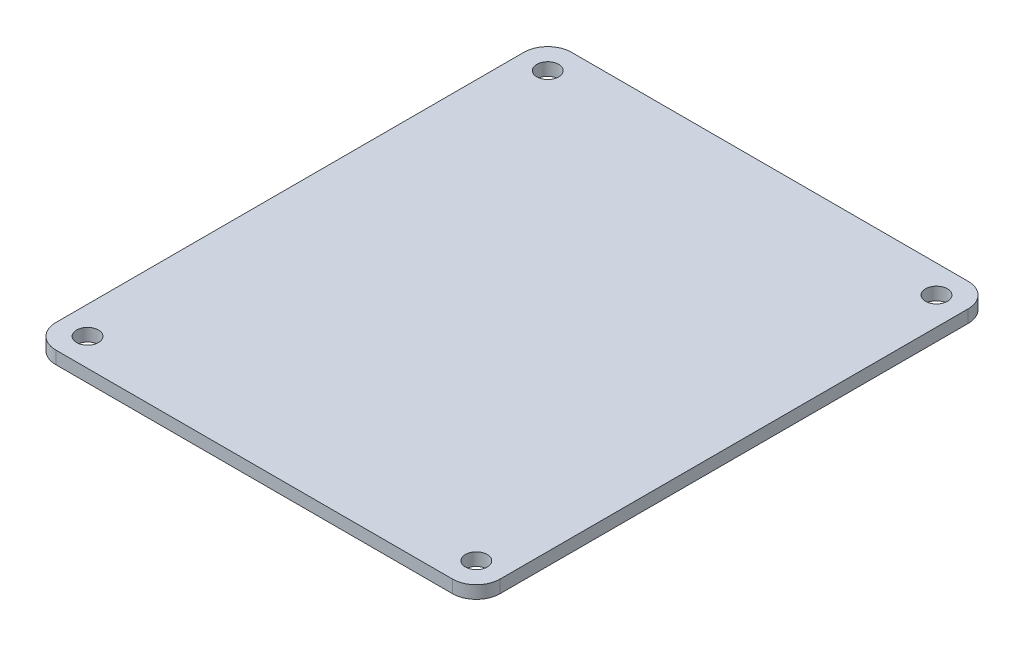
ISO-10303-21;
HEADER;
FILE_DESCRIPTION(('STEP AP214'),'2;1');
FILE_NAME('part.step','',(''),(''),'','','');
FILE_SCHEMA(('AUTOMOTIVE_DESIGN { 1 0 10303 214 1 1 1 1 }'));
ENDSEC;
DATA;
#1=APPLICATION_CONTEXT('core data for automotive mechanical design processes');
#2=APPLICATION_PROTOCOL_DEFINITION('international standard','automotive_design',2000,#1);
#3=PRODUCT_CONTEXT('',#1,'mechanical');
#4=PRODUCT('Part','Part','',(#3));
#5=PRODUCT_RELATED_PRODUCT_CATEGORY('part','',(#4));
#6=PRODUCT_DEFINITION_FORMATION('','',#4);
#7=PRODUCT_DEFINITION_CONTEXT('part definition',#1,'design');
#8=PRODUCT_DEFINITION('design','',#6,#7);
#9=PRODUCT_DEFINITION_SHAPE('','',#8);
#10=(LENGTH_UNIT() NAMED_UNIT(*) SI_UNIT(.MILLI.,.METRE.));
#11=(NAMED_UNIT(*) PLANE_ANGLE_UNIT() SI_UNIT($,.RADIAN.));
#12=(NAMED_UNIT(*) SI_UNIT($,.STERADIAN.) SOLID_ANGLE_UNIT());
#13=UNCERTAINTY_MEASURE_WITH_UNIT(LENGTH_MEASURE(1.E-05),#10,'distance_accuracy_value','');
#14=(GEOMETRIC_REPRESENTATION_CONTEXT(3) GLOBAL_UNCERTAINTY_ASSIGNED_CONTEXT((#13)) GLOBAL_UNIT_ASSIGNED_CONTEXT((#10,
#11,#12)) REPRESENTATION_CONTEXT('',''));
#15=CARTESIAN_POINT('',(0.,0.,0.));
#16=DIRECTION('',(0.,0.,1.));
#17=DIRECTION('',(1.,0.,0.));
#18=AXIS2_PLACEMENT_3D('',#15,#16,#17);
#19=CARTESIAN_POINT('',(3.00000000000001,1.6002,-61.9999999999998));
#20=DIRECTION('',(0.,-1.,0.));
#21=DIRECTION('',(0.,0.,-1.));
#22=AXIS2_PLACEMENT_3D('',#19,#20,#21);
#23=CYLINDRICAL_SURFACE('',#22,3.00000000000006);
#24=CARTESIAN_POINT('',(3.00000000000001,0.,-61.9999999999998));
#25=DIRECTION('',(0.,1.,0.));
#26=DIRECTION('',(0.,0.,-1.));
#27=AXIS2_PLACEMENT_3D('',#24,#25,#26);
#28=CIRCLE('',#27,3.00000000000006);
#29=CARTESIAN_POINT('',(3.,0.,-64.9999999999999));
#30=VERTEX_POINT('',#29);
#31=CARTESIAN_POINT('',(0.,0.,-61.9999999999998));
#32=VERTEX_POINT('',#31);
#33=EDGE_CURVE('E130',#30,#32,#28,.T.);
#34=ORIENTED_EDGE('',*,*,#33,.T.);
#35=DIRECTION('',(0.,-1.,0.));
#36=VECTOR('',#35,1.);
#37=CARTESIAN_POINT('',(0.,1.6002,-61.9999999999998));
#38=LINE('',#37,#36);
#39=CARTESIAN_POINT('',(0.,1.6002,-61.9999999999998));
#40=VERTEX_POINT('',#39);
#41=EDGE_CURVE('E11',#40,#32,#38,.T.);
#42=ORIENTED_EDGE('',*,*,#41,.F.);
#43=CARTESIAN_POINT('',(3.00000000000001,1.6002,-61.9999999999998));
#44=DIRECTION('',(0.,1.,0.));
#45=DIRECTION('',(0.,0.,-1.));
#46=AXIS2_PLACEMENT_3D('',#43,#44,#45);
#47=CIRCLE('',#46,3.00000000000006);
#48=CARTESIAN_POINT('',(3.,1.6002,-64.9999999999999));
#49=VERTEX_POINT('',#48);
#50=EDGE_CURVE('E145',#49,#40,#47,.T.);
#51=ORIENTED_EDGE('',*,*,#50,.F.);
#52=DIRECTION('',(0.,-1.,0.));
#53=VECTOR('',#52,1.);
#54=CARTESIAN_POINT('',(3.,1.6002,-64.9999999999999));
#55=LINE('',#54,#53);
#56=EDGE_CURVE('E126',#49,#30,#55,.T.);
#57=ORIENTED_EDGE('',*,*,#56,.T.);
#58=EDGE_LOOP('',(#34,#42,#51,#57));
#59=FACE_BOUND('',#58,.T.);
#60=ADVANCED_FACE('F34',(#59),#23,.T.);
#61=CARTESIAN_POINT('',(0.,1.6002,-3.00000000000002));
#62=DIRECTION('',(1.,0.,0.));
#63=DIRECTION('',(0.,0.,-1.));
#64=AXIS2_PLACEMENT_3D('',#61,#62,#63);
#65=PLANE('',#64);
#66=DIRECTION('',(0.,0.,1.));
#67=VECTOR('',#66,1.);
#68=CARTESIAN_POINT('',(0.,0.,-3.00000000000002));
#69=LINE('',#68,#67);
#70=CARTESIAN_POINT('',(0.,0.,-3.00000000000002));
#71=VERTEX_POINT('',#70);
#72=EDGE_CURVE('E133',#32,#71,#69,.T.);
#73=ORIENTED_EDGE('',*,*,#72,.T.);
#74=DIRECTION('',(0.,-1.,0.));
#75=VECTOR('',#74,1.);
#76=CARTESIAN_POINT('',(0.,1.6002,-3.00000000000002));
#77=LINE('',#76,#75);
#78=CARTESIAN_POINT('',(0.,1.6002,-3.00000000000002));
#79=VERTEX_POINT('',#78);
#80=EDGE_CURVE('E42',#79,#71,#77,.T.);
#81=ORIENTED_EDGE('',*,*,#80,.F.);
#82=DIRECTION('',(0.,0.,1.));
#83=VECTOR('',#82,1.);
#84=CARTESIAN_POINT('',(0.,1.6002,-3.00000000000002));
#85=LINE('',#84,#83);
#86=EDGE_CURVE('E93',#40,#79,#85,.T.);
#87=ORIENTED_EDGE('',*,*,#86,.F.);
#88=ORIENTED_EDGE('',*,*,#41,.T.);
#89=EDGE_LOOP('',(#73,#81,#87,#88));
#90=FACE_BOUND('',#89,.T.);
#91=ADVANCED_FACE('F230',(#90),#65,.F.);
#92=CARTESIAN_POINT('',(3.,1.6002,-3.));
#93=DIRECTION('',(0.,-1.,0.));
#94=DIRECTION('',(0.,0.,-1.));
#95=AXIS2_PLACEMENT_3D('',#92,#93,#94);
#96=CYLINDRICAL_SURFACE('',#95,3.);
#97=CARTESIAN_POINT('',(3.,0.,-3.));
#98=DIRECTION('',(0.,1.,0.));
#99=DIRECTION('',(0.,0.,-1.));
#100=AXIS2_PLACEMENT_3D('',#97,#98,#99);
#101=CIRCLE('',#100,3.);
#102=CARTESIAN_POINT('',(3.00000000000002,0.,0.));
#103=VERTEX_POINT('',#102);
#104=EDGE_CURVE('E136',#71,#103,#101,.T.);
#105=ORIENTED_EDGE('',*,*,#104,.T.);
#106=DIRECTION('',(0.,-1.,0.));
#107=VECTOR('',#106,1.);
#108=CARTESIAN_POINT('',(3.00000000000002,1.6002,0.));
#109=LINE('',#108,#107);
#110=CARTESIAN_POINT('',(3.00000000000002,1.6002,0.));
#111=VERTEX_POINT('',#110);
#112=EDGE_CURVE('E152',#111,#103,#109,.T.);
#113=ORIENTED_EDGE('',*,*,#112,.F.);
#114=CARTESIAN_POINT('',(3.,1.6002,-3.));
#115=DIRECTION('',(0.,1.,0.));
#116=DIRECTION('',(0.,0.,-1.));
#117=AXIS2_PLACEMENT_3D('',#114,#115,#116);
#118=CIRCLE('',#117,3.);
#119=EDGE_CURVE('E160',#79,#111,#118,.T.);
#120=ORIENTED_EDGE('',*,*,#119,.F.);
#121=ORIENTED_EDGE('',*,*,#80,.T.);
#122=EDGE_LOOP('',(#105,#113,#120,#121));
#123=FACE_BOUND('',#122,.T.);
#124=ADVANCED_FACE('F158',(#123),#96,.T.);
#125=CARTESIAN_POINT('',(3.00000000000002,1.6002,0.));
#126=DIRECTION('',(0.,0.,-1.));
#127=DIRECTION('',(-1.,0.,0.));
#128=AXIS2_PLACEMENT_3D('',#125,#126,#127);
#129=PLANE('',#128);
#130=DIRECTION('',(1.,0.,0.));
#131=VECTOR('',#130,1.);
#132=CARTESIAN_POINT('',(3.00000000000002,0.,0.));
#133=LINE('',#132,#131);
#134=CARTESIAN_POINT('',(53.,0.,0.));
#135=VERTEX_POINT('',#134);
#136=EDGE_CURVE('E138',#103,#135,#133,.T.);
#137=ORIENTED_EDGE('',*,*,#136,.T.);
#138=DIRECTION('',(0.,-1.,0.));
#139=VECTOR('',#138,1.);
#140=CARTESIAN_POINT('',(53.,1.6002,0.));
#141=LINE('',#140,#139);
#142=CARTESIAN_POINT('',(53.,1.6002,0.));
#143=VERTEX_POINT('',#142);
#144=EDGE_CURVE('E149',#143,#135,#141,.T.);
#145=ORIENTED_EDGE('',*,*,#144,.F.);
#146=DIRECTION('',(1.,0.,0.));
#147=VECTOR('',#146,1.);
#148=CARTESIAN_POINT('',(3.00000000000002,1.6002,0.));
#149=LINE('',#148,#147);
#150=EDGE_CURVE('E172',#111,#143,#149,.T.);
#151=ORIENTED_EDGE('',*,*,#150,.F.);
#152=ORIENTED_EDGE('',*,*,#112,.T.);
#153=EDGE_LOOP('',(#137,#145,#151,#152));
#154=FACE_BOUND('',#153,.T.);
#155=ADVANCED_FACE('F168',(#154),#129,.F.);
#156=CARTESIAN_POINT('',(53.,1.6002,-3.));
#157=DIRECTION('',(0.,-1.,0.));
#158=DIRECTION('',(0.,0.,-1.));
#159=AXIS2_PLACEMENT_3D('',#156,#157,#158);
#160=CYLINDRICAL_SURFACE('',#159,3.);
#161=CARTESIAN_POINT('',(53.,0.,-3.));
#162=DIRECTION('',(0.,1.,0.));
#163=DIRECTION('',(0.,0.,1.));
#164=AXIS2_PLACEMENT_3D('',#161,#162,#163);
#165=CIRCLE('',#164,3.);
#166=CARTESIAN_POINT('',(56.,0.,-2.99999999999999));
#167=VERTEX_POINT('',#166);
#168=EDGE_CURVE('E140',#135,#167,#165,.T.);
#169=ORIENTED_EDGE('',*,*,#168,.T.);
#170=DIRECTION('',(0.,-1.,0.));
#171=VECTOR('',#170,1.);
#172=CARTESIAN_POINT('',(56.,1.6002,-2.99999999999999));
#173=LINE('',#172,#171);
#174=CARTESIAN_POINT('',(56.,1.6002,-2.99999999999999));
#175=VERTEX_POINT('',#174);
#176=EDGE_CURVE('E121',#175,#167,#173,.T.);
#177=ORIENTED_EDGE('',*,*,#176,.F.);
#178=CARTESIAN_POINT('',(53.,1.6002,-3.));
#179=DIRECTION('',(0.,1.,0.));
#180=DIRECTION('',(0.,0.,1.));
#181=AXIS2_PLACEMENT_3D('',#178,#179,#180);
#182=CIRCLE('',#181,3.);
#183=EDGE_CURVE('E112',#143,#175,#182,.T.);
#184=ORIENTED_EDGE('',*,*,#183,.F.);
#185=ORIENTED_EDGE('',*,*,#144,.T.);
#186=EDGE_LOOP('',(#169,#177,#184,#185));
#187=FACE_BOUND('',#186,.T.);
#188=ADVANCED_FACE('F171',(#187),#160,.T.);
#189=CARTESIAN_POINT('',(56.,1.6002,-2.99999999999999));
#190=DIRECTION('',(-1.,0.,0.));
#191=DIRECTION('',(0.,0.,1.));
#192=AXIS2_PLACEMENT_3D('',#189,#190,#191);
#193=PLANE('',#192);
#194=DIRECTION('',(0.,0.,-1.));
#195=VECTOR('',#194,1.);
#196=CARTESIAN_POINT('',(56.,0.,-2.99999999999999));
#197=LINE('',#196,#195);
#198=CARTESIAN_POINT('',(56.,0.,-61.9999999999998));
#199=VERTEX_POINT('',#198);
#200=EDGE_CURVE('E120',#167,#199,#197,.T.);
#201=ORIENTED_EDGE('',*,*,#200,.T.);
#202=DIRECTION('',(0.,-1.,0.));
#203=VECTOR('',#202,1.);
#204=CARTESIAN_POINT('',(56.,1.6002,-61.9999999999998));
#205=LINE('',#204,#203);
#206=CARTESIAN_POINT('',(56.,1.6002,-61.9999999999998));
#207=VERTEX_POINT('',#206);
#208=EDGE_CURVE('E117',#207,#199,#205,.T.);
#209=ORIENTED_EDGE('',*,*,#208,.F.);
#210=DIRECTION('',(0.,0.,-1.));
#211=VECTOR('',#210,1.);
#212=CARTESIAN_POINT('',(56.,1.6002,-2.99999999999999));
#213=LINE('',#212,#211);
#214=EDGE_CURVE('E106',#175,#207,#213,.T.);
#215=ORIENTED_EDGE('',*,*,#214,.F.);
#216=ORIENTED_EDGE('',*,*,#176,.T.);
#217=EDGE_LOOP('',(#201,#209,#215,#216));
#218=FACE_BOUND('',#217,.T.);
#219=ADVANCED_FACE('F118',(#218),#193,.F.);
#220=CARTESIAN_POINT('',(53.,1.6002,-61.9999999999998));
#221=DIRECTION('',(0.,-1.,0.));
#222=DIRECTION('',(0.,0.,-1.));
#223=AXIS2_PLACEMENT_3D('',#220,#221,#222);
#224=CYLINDRICAL_SURFACE('',#223,3.00000000000006);
#225=CARTESIAN_POINT('',(53.,0.,-61.9999999999998));
#226=DIRECTION('',(0.,1.,0.));
#227=DIRECTION('',(0.,0.,-1.));
#228=AXIS2_PLACEMENT_3D('',#225,#226,#227);
#229=CIRCLE('',#228,3.00000000000006);
#230=CARTESIAN_POINT('',(53.,0.,-64.9999999999999));
#231=VERTEX_POINT('',#230);
#232=EDGE_CURVE('E79',#199,#231,#229,.T.);
#233=ORIENTED_EDGE('',*,*,#232,.T.);
#234=DIRECTION('',(0.,-1.,0.));
#235=VECTOR('',#234,1.);
#236=CARTESIAN_POINT('',(53.,1.6002,-64.9999999999999));
#237=LINE('',#236,#235);
#238=CARTESIAN_POINT('',(53.,1.6002,-64.9999999999999));
#239=VERTEX_POINT('',#238);
#240=EDGE_CURVE('E122',#239,#231,#237,.T.);
#241=ORIENTED_EDGE('',*,*,#240,.F.);
#242=CARTESIAN_POINT('',(53.,1.6002,-61.9999999999998));
#243=DIRECTION('',(0.,1.,0.));
#244=DIRECTION('',(0.,0.,-1.));
#245=AXIS2_PLACEMENT_3D('',#242,#243,#244);
#246=CIRCLE('',#245,3.00000000000006);
#247=EDGE_CURVE('E110',#207,#239,#246,.T.);
#248=ORIENTED_EDGE('',*,*,#247,.F.);
#249=ORIENTED_EDGE('',*,*,#208,.T.);
#250=EDGE_LOOP('',(#233,#241,#248,#249));
#251=FACE_BOUND('',#250,.T.);
#252=ADVANCED_FACE('F124',(#251),#224,.T.);
#253=CARTESIAN_POINT('',(3.,1.6002,-64.9999999999999));
#254=DIRECTION('',(0.,0.,1.));
#255=DIRECTION('',(1.,0.,0.));
#256=AXIS2_PLACEMENT_3D('',#253,#254,#255);
#257=PLANE('',#256);
#258=DIRECTION('',(-1.,0.,0.));
#259=VECTOR('',#258,1.);
#260=CARTESIAN_POINT('',(3.,0.,-64.9999999999999));
#261=LINE('',#260,#259);
#262=EDGE_CURVE('E85',#231,#30,#261,.T.);
#263=ORIENTED_EDGE('',*,*,#262,.T.);
#264=ORIENTED_EDGE('',*,*,#56,.F.);
#265=DIRECTION('',(-1.,0.,0.));
#266=VECTOR('',#265,1.);
#267=CARTESIAN_POINT('',(3.,1.6002,-64.9999999999999));
#268=LINE('',#267,#266);
#269=EDGE_CURVE('E50',#239,#49,#268,.T.);
#270=ORIENTED_EDGE('',*,*,#269,.F.);
#271=ORIENTED_EDGE('',*,*,#240,.T.);
#272=EDGE_LOOP('',(#263,#264,#270,#271));
#273=FACE_BOUND('',#272,.T.);
#274=ADVANCED_FACE('F206',(#273),#257,.F.);
#275=CARTESIAN_POINT('',(3.00000000000001,1.6002,-61.9999999999998));
#276=DIRECTION('',(0.,-1.,0.));
#277=DIRECTION('',(0.,0.,-1.));
#278=AXIS2_PLACEMENT_3D('',#275,#276,#277);
#279=PLANE('',#278);
#280=CARTESIAN_POINT('',(3.50000000000001,1.6002,-61.4999999999999));
#281=DIRECTION('',(0.,1.,0.));
#282=DIRECTION('',(0.,0.,1.));
#283=AXIS2_PLACEMENT_3D('',#280,#281,#282);
#284=CIRCLE('',#283,1.375);
#285=CARTESIAN_POINT('',(3.50000000000001,1.6002,-60.1249999999999));
#286=VERTEX_POINT('',#285);
#287=EDGE_CURVE('E198',#286,#286,#284,.T.);
#288=ORIENTED_EDGE('',*,*,#287,.F.);
#289=EDGE_LOOP('',(#288));
#290=FACE_BOUND('',#289,.T.);
#291=CARTESIAN_POINT('',(3.50000000000001,1.6002,-3.49999999999988));
#292=DIRECTION('',(0.,1.,0.));
#293=DIRECTION('',(0.,0.,1.));
#294=AXIS2_PLACEMENT_3D('',#291,#292,#293);
#295=CIRCLE('',#294,1.375);
#296=CARTESIAN_POINT('',(3.50000000000001,1.6002,-2.12499999999989));
#297=VERTEX_POINT('',#296);
#298=EDGE_CURVE('E192',#297,#297,#295,.T.);
#299=ORIENTED_EDGE('',*,*,#298,.F.);
#300=EDGE_LOOP('',(#299));
#301=FACE_BOUND('',#300,.T.);
#302=CARTESIAN_POINT('',(52.5,1.6002,-61.4999999999999));
#303=DIRECTION('',(0.,1.,0.));
#304=DIRECTION('',(0.,0.,1.));
#305=AXIS2_PLACEMENT_3D('',#302,#303,#304);
#306=CIRCLE('',#305,1.375);
#307=CARTESIAN_POINT('',(52.5,1.6002,-60.1249999999999));
#308=VERTEX_POINT('',#307);
#309=EDGE_CURVE('E186',#308,#308,#306,.T.);
#310=ORIENTED_EDGE('',*,*,#309,.F.);
#311=EDGE_LOOP('',(#310));
#312=FACE_BOUND('',#311,.T.);
#313=CARTESIAN_POINT('',(52.5,1.6002,-3.49999999999988));
#314=DIRECTION('',(0.,1.,0.));
#315=DIRECTION('',(0.,0.,1.));
#316=AXIS2_PLACEMENT_3D('',#313,#314,#315);
#317=CIRCLE('',#316,1.375);
#318=CARTESIAN_POINT('',(52.5,1.6002,-2.12499999999988));
#319=VERTEX_POINT('',#318);
#320=EDGE_CURVE('E180',#319,#319,#317,.T.);
#321=ORIENTED_EDGE('',*,*,#320,.F.);
#322=EDGE_LOOP('',(#321));
#323=FACE_BOUND('',#322,.T.);
#324=ORIENTED_EDGE('',*,*,#50,.T.);
#325=ORIENTED_EDGE('',*,*,#86,.T.);
#326=ORIENTED_EDGE('',*,*,#119,.T.);
#327=ORIENTED_EDGE('',*,*,#150,.T.);
#328=ORIENTED_EDGE('',*,*,#183,.T.);
#329=ORIENTED_EDGE('',*,*,#214,.T.);
#330=ORIENTED_EDGE('',*,*,#247,.T.);
#331=ORIENTED_EDGE('',*,*,#269,.T.);
#332=EDGE_LOOP('',(#324,#325,#326,#327,#328,#329,#330,#331));
#333=FACE_BOUND('',#332,.T.);
#334=ADVANCED_FACE('F108',(#290,#301,#312,#323,#333),#279,.F.);
#335=CARTESIAN_POINT('',(3.00000000000001,0.,-61.9999999999998));
#336=DIRECTION('',(0.,-1.,0.));
#337=DIRECTION('',(0.,0.,-1.));
#338=AXIS2_PLACEMENT_3D('',#335,#336,#337);
#339=PLANE('',#338);
#340=CARTESIAN_POINT('',(3.50000000000001,0.,-61.4999999999999));
#341=DIRECTION('',(0.,1.,0.));
#342=DIRECTION('',(0.,0.,1.));
#343=AXIS2_PLACEMENT_3D('',#340,#341,#342);
#344=CIRCLE('',#343,1.375);
#345=CARTESIAN_POINT('',(3.50000000000001,0.,-60.1249999999999));
#346=VERTEX_POINT('',#345);
#347=EDGE_CURVE('E195',#346,#346,#344,.T.);
#348=ORIENTED_EDGE('',*,*,#347,.T.);
#349=EDGE_LOOP('',(#348));
#350=FACE_BOUND('',#349,.T.);
#351=CARTESIAN_POINT('',(3.50000000000001,0.,-3.49999999999988));
#352=DIRECTION('',(0.,1.,0.));
#353=DIRECTION('',(0.,0.,1.));
#354=AXIS2_PLACEMENT_3D('',#351,#352,#353);
#355=CIRCLE('',#354,1.375);
#356=CARTESIAN_POINT('',(3.50000000000001,0.,-2.12499999999989));
#357=VERTEX_POINT('',#356);
#358=EDGE_CURVE('E189',#357,#357,#355,.T.);
#359=ORIENTED_EDGE('',*,*,#358,.T.);
#360=EDGE_LOOP('',(#359));
#361=FACE_BOUND('',#360,.T.);
#362=CARTESIAN_POINT('',(52.5,0.,-61.4999999999999));
#363=DIRECTION('',(0.,1.,0.));
#364=DIRECTION('',(0.,0.,1.));
#365=AXIS2_PLACEMENT_3D('',#362,#363,#364);
#366=CIRCLE('',#365,1.375);
#367=CARTESIAN_POINT('',(52.5,0.,-60.1249999999999));
#368=VERTEX_POINT('',#367);
#369=EDGE_CURVE('E183',#368,#368,#366,.T.);
#370=ORIENTED_EDGE('',*,*,#369,.T.);
#371=EDGE_LOOP('',(#370));
#372=FACE_BOUND('',#371,.T.);
#373=CARTESIAN_POINT('',(52.5,0.,-3.49999999999988));
#374=DIRECTION('',(0.,1.,0.));
#375=DIRECTION('',(0.,0.,1.));
#376=AXIS2_PLACEMENT_3D('',#373,#374,#375);
#377=CIRCLE('',#376,1.375);
#378=CARTESIAN_POINT('',(52.5,0.,-2.12499999999988));
#379=VERTEX_POINT('',#378);
#380=EDGE_CURVE('E134',#379,#379,#377,.T.);
#381=ORIENTED_EDGE('',*,*,#380,.T.);
#382=EDGE_LOOP('',(#381));
#383=FACE_BOUND('',#382,.T.);
#384=ORIENTED_EDGE('',*,*,#33,.F.);
#385=ORIENTED_EDGE('',*,*,#262,.F.);
#386=ORIENTED_EDGE('',*,*,#232,.F.);
#387=ORIENTED_EDGE('',*,*,#200,.F.);
#388=ORIENTED_EDGE('',*,*,#168,.F.);
#389=ORIENTED_EDGE('',*,*,#136,.F.);
#390=ORIENTED_EDGE('',*,*,#104,.F.);
#391=ORIENTED_EDGE('',*,*,#72,.F.);
#392=EDGE_LOOP('',(#384,#385,#386,#387,#388,#389,#390,#391));
#393=FACE_BOUND('',#392,.T.);
#394=ADVANCED_FACE('F164',(#350,#361,#372,#383,#393),#339,.T.);
#395=CARTESIAN_POINT('',(52.5,1.6002,-3.49999999999988));
#396=DIRECTION('',(0.,1.,0.));
#397=DIRECTION('',(0.,0.,1.));
#398=AXIS2_PLACEMENT_3D('',#395,#396,#397);
#399=CYLINDRICAL_SURFACE('',#398,1.375);
#400=ORIENTED_EDGE('',*,*,#380,.F.);
#401=EDGE_LOOP('',(#400));
#402=FACE_BOUND('',#401,.T.);
#403=ORIENTED_EDGE('',*,*,#320,.T.);
#404=EDGE_LOOP('',(#403));
#405=FACE_BOUND('',#404,.T.);
#406=ADVANCED_FACE('F214',(#402,#405),#399,.F.);
#407=CARTESIAN_POINT('',(52.5,1.6002,-61.4999999999999));
#408=DIRECTION('',(0.,1.,0.));
#409=DIRECTION('',(0.,0.,1.));
#410=AXIS2_PLACEMENT_3D('',#407,#408,#409);
#411=CYLINDRICAL_SURFACE('',#410,1.375);
#412=ORIENTED_EDGE('',*,*,#369,.F.);
#413=EDGE_LOOP('',(#412));
#414=FACE_BOUND('',#413,.T.);
#415=ORIENTED_EDGE('',*,*,#309,.T.);
#416=EDGE_LOOP('',(#415));
#417=FACE_BOUND('',#416,.T.);
#418=ADVANCED_FACE('F216',(#414,#417),#411,.F.);
#419=CARTESIAN_POINT('',(3.50000000000001,1.6002,-3.49999999999988));
#420=DIRECTION('',(0.,1.,0.));
#421=DIRECTION('',(0.,0.,1.));
#422=AXIS2_PLACEMENT_3D('',#419,#420,#421);
#423=CYLINDRICAL_SURFACE('',#422,1.375);
#424=ORIENTED_EDGE('',*,*,#358,.F.);
#425=EDGE_LOOP('',(#424));
#426=FACE_BOUND('',#425,.T.);
#427=ORIENTED_EDGE('',*,*,#298,.T.);
#428=EDGE_LOOP('',(#427));
#429=FACE_BOUND('',#428,.T.);
#430=ADVANCED_FACE('F223',(#426,#429),#423,.F.);
#431=CARTESIAN_POINT('',(3.50000000000001,1.6002,-61.4999999999999));
#432=DIRECTION('',(0.,1.,0.));
#433=DIRECTION('',(0.,0.,1.));
#434=AXIS2_PLACEMENT_3D('',#431,#432,#433);
#435=CYLINDRICAL_SURFACE('',#434,1.375);
#436=ORIENTED_EDGE('',*,*,#347,.F.);
#437=EDGE_LOOP('',(#436));
#438=FACE_BOUND('',#437,.T.);
#439=ORIENTED_EDGE('',*,*,#287,.T.);
#440=EDGE_LOOP('',(#439));
#441=FACE_BOUND('',#440,.T.);
#442=ADVANCED_FACE('F202',(#438,#441),#435,.F.);
#443=CLOSED_SHELL('',(#60,#91,#124,#155,#188,#219,#252,#274,#334,#394,#406,#418,#430,#442));
#444=MANIFOLD_SOLID_BREP('B2',#443);
#445=ADVANCED_BREP_SHAPE_REPRESENTATION('',(#18,#444),#14);
#446=SHAPE_DEFINITION_REPRESENTATION(#9,#445);
ENDSEC;
END-ISO-10303-21;
